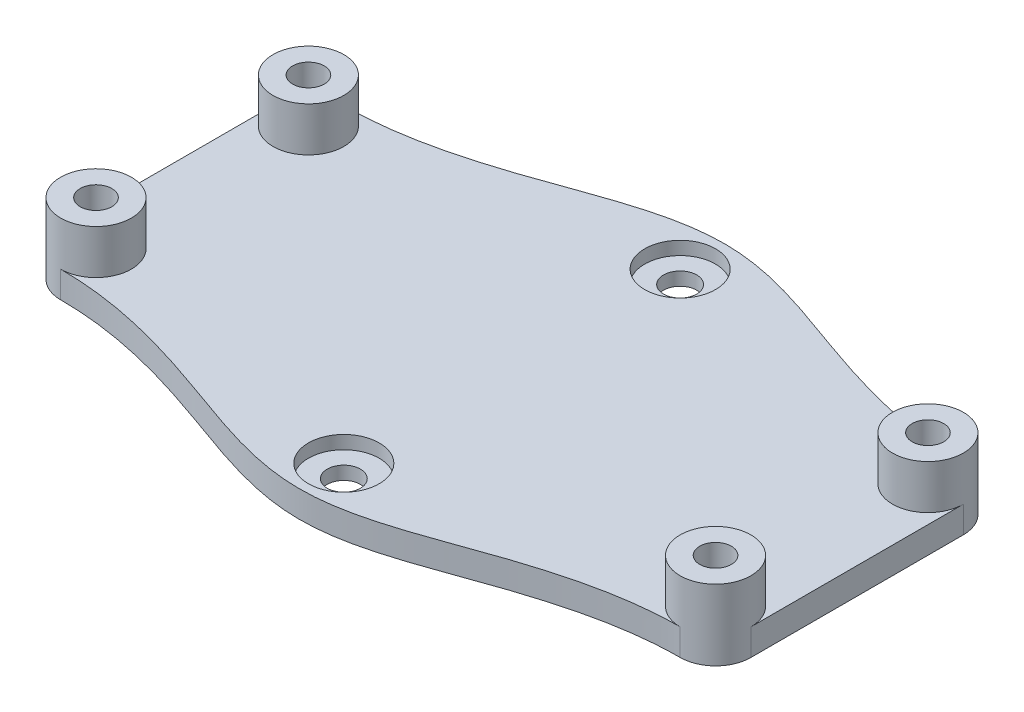
ISO-10303-21;
HEADER;
FILE_DESCRIPTION(('STEP AP214'),'2;1');
FILE_NAME('part.step','',(''),(''),'','','');
FILE_SCHEMA(('AUTOMOTIVE_DESIGN { 1 0 10303 214 1 1 1 1 }'));
ENDSEC;
DATA;
#1=APPLICATION_CONTEXT('core data for automotive mechanical design processes');
#2=APPLICATION_PROTOCOL_DEFINITION('international standard','automotive_design',2000,#1);
#3=PRODUCT_CONTEXT('',#1,'mechanical');
#4=PRODUCT('Part','Part','',(#3));
#5=PRODUCT_RELATED_PRODUCT_CATEGORY('part','',(#4));
#6=PRODUCT_DEFINITION_FORMATION('','',#4);
#7=PRODUCT_DEFINITION_CONTEXT('part definition',#1,'design');
#8=PRODUCT_DEFINITION('design','',#6,#7);
#9=PRODUCT_DEFINITION_SHAPE('','',#8);
#10=(LENGTH_UNIT() NAMED_UNIT(*) SI_UNIT(.MILLI.,.METRE.));
#11=(NAMED_UNIT(*) PLANE_ANGLE_UNIT() SI_UNIT($,.RADIAN.));
#12=(NAMED_UNIT(*) SI_UNIT($,.STERADIAN.) SOLID_ANGLE_UNIT());
#13=UNCERTAINTY_MEASURE_WITH_UNIT(LENGTH_MEASURE(1.E-05),#10,'distance_accuracy_value','');
#14=(GEOMETRIC_REPRESENTATION_CONTEXT(3) GLOBAL_UNCERTAINTY_ASSIGNED_CONTEXT((#13)) GLOBAL_UNIT_ASSIGNED_CONTEXT((#10,
#11,#12)) REPRESENTATION_CONTEXT('',''));
#15=CARTESIAN_POINT('',(0.,0.,0.));
#16=DIRECTION('',(0.,0.,1.));
#17=DIRECTION('',(1.,0.,0.));
#18=AXIS2_PLACEMENT_3D('',#15,#16,#17);
#19=CARTESIAN_POINT('',(-36.2518684526485,-3.,-6.01017819083383));
#20=DIRECTION('',(0.,1.,0.));
#21=DIRECTION('',(0.,0.,1.));
#22=AXIS2_PLACEMENT_3D('',#19,#20,#21);
#23=CYLINDRICAL_SURFACE('',#22,4.);
#24=DIRECTION('',(0.,1.,0.));
#25=VECTOR('',#24,1.);
#26=CARTESIAN_POINT('',(-40.2518684526485,-3.,-6.01017819083383));
#27=LINE('',#26,#25);
#28=CARTESIAN_POINT('',(-40.2518684526485,-3.,-6.01017819083383));
#29=VERTEX_POINT('',#28);
#30=CARTESIAN_POINT('',(-40.2518684526485,0.,-6.01017819083383));
#31=VERTEX_POINT('',#30);
#32=EDGE_CURVE('E91',#29,#31,#27,.T.);
#33=ORIENTED_EDGE('',*,*,#32,.T.);
#34=CARTESIAN_POINT('',(-36.2518684526485,0.,-6.01017819083383));
#35=DIRECTION('',(0.,-1.,0.));
#36=DIRECTION('',(0.,0.,-1.));
#37=AXIS2_PLACEMENT_3D('',#34,#35,#36);
#38=CIRCLE('',#37,4.);
#39=CARTESIAN_POINT('',(-36.2518684526485,0.,-10.0101781908338));
#40=VERTEX_POINT('',#39);
#41=EDGE_CURVE('E277',#31,#40,#38,.F.);
#42=ORIENTED_EDGE('',*,*,#41,.T.);
#43=DIRECTION('',(0.,1.,0.));
#44=VECTOR('',#43,1.);
#45=CARTESIAN_POINT('',(-36.2518684526485,-3.,-10.0101781908338));
#46=LINE('',#45,#44);
#47=CARTESIAN_POINT('',(-36.2518684526485,-3.,-10.0101781908338));
#48=VERTEX_POINT('',#47);
#49=EDGE_CURVE('E58',#48,#40,#46,.T.);
#50=ORIENTED_EDGE('',*,*,#49,.F.);
#51=CARTESIAN_POINT('',(-36.2518684526485,-3.,-6.01017819083383));
#52=DIRECTION('',(0.,1.,0.));
#53=DIRECTION('',(0.,0.,-1.));
#54=AXIS2_PLACEMENT_3D('',#51,#52,#53);
#55=CIRCLE('',#54,4.);
#56=EDGE_CURVE('E186',#48,#29,#55,.T.);
#57=ORIENTED_EDGE('',*,*,#56,.T.);
#58=EDGE_LOOP('',(#33,#42,#50,#57));
#59=FACE_BOUND('',#58,.T.);
#60=CARTESIAN_POINT('',(-36.2518684526485,5.,-6.01017819083383));
#61=DIRECTION('',(0.,1.,0.));
#62=DIRECTION('',(0.,0.,1.));
#63=AXIS2_PLACEMENT_3D('',#60,#61,#62);
#64=CIRCLE('',#63,4.);
#65=CARTESIAN_POINT('',(-36.2518684526485,5.,-2.01017819083383));
#66=VERTEX_POINT('',#65);
#67=EDGE_CURVE('E203',#66,#66,#64,.T.);
#68=ORIENTED_EDGE('',*,*,#67,.F.);
#69=EDGE_LOOP('',(#68));
#70=FACE_BOUND('',#69,.T.);
#71=ADVANCED_FACE('F39',(#59,#70),#23,.T.);
#72=CARTESIAN_POINT('',(33.7481315473515,-3.,-10.0101781908338));
#73=CARTESIAN_POINT('',(27.8238619002682,-3.,-10.0101781908338));
#74=CARTESIAN_POINT('',(16.740137150134,-3.,-12.8935152807625));
#75=CARTESIAN_POINT('',(4.57410249745538,-3.,-18.0325564843901));
#76=CARTESIAN_POINT('',(-7.07782545586437,-3.,-18.032556484398));
#77=CARTESIAN_POINT('',(-19.2470629279089,-3.,-12.8935152807587));
#78=CARTESIAN_POINT('',(-30.3202470507345,-3.,-10.0101781908338));
#79=CARTESIAN_POINT('',(-36.2518684526485,-3.,-10.0101781908338));
#80=B_SPLINE_CURVE_WITH_KNOTS('',3,(#72,#73,#74,#75,#76,#77,#78,#79),.UNSPECIFIED.,.F.,.F.,(4,1,
1,1,1,4),(0.,0.248449552771805,0.47484495527718,0.525155044722819,0.751550447228195,1.),.UNSPECIFIED.);
#81=DIRECTION('',(0.,1.,0.));
#82=VECTOR('',#81,1.);
#83=SURFACE_OF_LINEAR_EXTRUSION('',#80,#82);
#84=CARTESIAN_POINT('',(33.7481315473515,0.,-10.0101781908338));
#85=CARTESIAN_POINT('',(27.8238619002682,0.,-10.0101781908338));
#86=CARTESIAN_POINT('',(16.740137150134,0.,-12.8935152807625));
#87=CARTESIAN_POINT('',(4.57410249745538,0.,-18.0325564843901));
#88=CARTESIAN_POINT('',(-7.07782545586437,0.,-18.032556484398));
#89=CARTESIAN_POINT('',(-19.2470629279089,0.,-12.8935152807587));
#90=CARTESIAN_POINT('',(-30.3202470507345,0.,-10.0101781908338));
#91=CARTESIAN_POINT('',(-36.2518684526485,0.,-10.0101781908338));
#92=B_SPLINE_CURVE_WITH_KNOTS('',3,(#84,#85,#86,#87,#88,#89,#90,#91),.UNSPECIFIED.,.F.,.F.,(4,1,
1,1,1,4),(0.,0.248449552771805,0.47484495527718,0.525155044722819,0.751550447228195,1.),.UNSPECIFIED.);
#93=CARTESIAN_POINT('',(33.7481315473515,0.,-10.0101781908338));
#94=VERTEX_POINT('',#93);
#95=EDGE_CURVE('E189',#94,#40,#92,.T.);
#96=ORIENTED_EDGE('',*,*,#95,.F.);
#97=DIRECTION('',(0.,1.,0.));
#98=VECTOR('',#97,1.);
#99=CARTESIAN_POINT('',(33.7481315473515,-3.,-10.0101781908338));
#100=LINE('',#99,#98);
#101=CARTESIAN_POINT('',(33.7481315473515,-3.,-10.0101781908338));
#102=VERTEX_POINT('',#101);
#103=EDGE_CURVE('E117',#102,#94,#100,.T.);
#104=ORIENTED_EDGE('',*,*,#103,.F.);
#105=EDGE_CURVE('E127',#102,#48,#80,.T.);
#106=ORIENTED_EDGE('',*,*,#105,.T.);
#107=ORIENTED_EDGE('',*,*,#49,.T.);
#108=EDGE_LOOP('',(#96,#104,#106,#107));
#109=FACE_BOUND('',#108,.T.);
#110=ADVANCED_FACE('F150',(#109),#83,.T.);
#111=CARTESIAN_POINT('',(33.7481315473515,-3.,-6.01017819083383));
#112=DIRECTION('',(0.,1.,0.));
#113=DIRECTION('',(0.,0.,1.));
#114=AXIS2_PLACEMENT_3D('',#111,#112,#113);
#115=CYLINDRICAL_SURFACE('',#114,4.);
#116=ORIENTED_EDGE('',*,*,#103,.T.);
#117=CARTESIAN_POINT('',(33.7481315473515,0.,-6.01017819083383));
#118=DIRECTION('',(0.,-1.,0.));
#119=DIRECTION('',(0.,0.,-1.));
#120=AXIS2_PLACEMENT_3D('',#117,#118,#119);
#121=CIRCLE('',#120,4.);
#122=CARTESIAN_POINT('',(37.7481315473515,0.,-6.01017819083383));
#123=VERTEX_POINT('',#122);
#124=EDGE_CURVE('E49',#94,#123,#121,.F.);
#125=ORIENTED_EDGE('',*,*,#124,.T.);
#126=DIRECTION('',(0.,1.,0.));
#127=VECTOR('',#126,1.);
#128=CARTESIAN_POINT('',(37.7481315473515,-3.,-6.01017819083383));
#129=LINE('',#128,#127);
#130=CARTESIAN_POINT('',(37.7481315473515,-3.,-6.01017819083383));
#131=VERTEX_POINT('',#130);
#132=EDGE_CURVE('E83',#131,#123,#129,.T.);
#133=ORIENTED_EDGE('',*,*,#132,.F.);
#134=CARTESIAN_POINT('',(33.7481315473515,-3.,-6.01017819083383));
#135=DIRECTION('',(0.,1.,0.));
#136=DIRECTION('',(0.,0.,1.));
#137=AXIS2_PLACEMENT_3D('',#134,#135,#136);
#138=CIRCLE('',#137,4.);
#139=EDGE_CURVE('E113',#131,#102,#138,.T.);
#140=ORIENTED_EDGE('',*,*,#139,.T.);
#141=EDGE_LOOP('',(#116,#125,#133,#140));
#142=FACE_BOUND('',#141,.T.);
#143=CARTESIAN_POINT('',(33.7481315473515,5.,-6.01017819083383));
#144=DIRECTION('',(0.,1.,0.));
#145=DIRECTION('',(0.,0.,1.));
#146=AXIS2_PLACEMENT_3D('',#143,#144,#145);
#147=CIRCLE('',#146,4.);
#148=CARTESIAN_POINT('',(33.7481315473515,5.,-2.01017819083383));
#149=VERTEX_POINT('',#148);
#150=EDGE_CURVE('E215',#149,#149,#147,.T.);
#151=ORIENTED_EDGE('',*,*,#150,.F.);
#152=EDGE_LOOP('',(#151));
#153=FACE_BOUND('',#152,.T.);
#154=ADVANCED_FACE('F111',(#142,#153),#115,.T.);
#155=CARTESIAN_POINT('',(37.7481315473515,-3.,-6.01017819083383));
#156=DIRECTION('',(1.,0.,0.));
#157=DIRECTION('',(0.,0.,-1.));
#158=AXIS2_PLACEMENT_3D('',#155,#156,#157);
#159=PLANE('',#158);
#160=DIRECTION('',(0.,0.,-1.));
#161=VECTOR('',#160,1.);
#162=CARTESIAN_POINT('',(37.7481315473515,0.,-6.01017819083383));
#163=LINE('',#162,#161);
#164=CARTESIAN_POINT('',(37.7481315473515,0.,17.9898218091662));
#165=VERTEX_POINT('',#164);
#166=EDGE_CURVE('E304',#165,#123,#163,.T.);
#167=ORIENTED_EDGE('',*,*,#166,.F.);
#168=DIRECTION('',(0.,1.,0.));
#169=VECTOR('',#168,1.);
#170=CARTESIAN_POINT('',(37.7481315473515,-3.,17.9898218091662));
#171=LINE('',#170,#169);
#172=CARTESIAN_POINT('',(37.7481315473515,-3.,17.9898218091662));
#173=VERTEX_POINT('',#172);
#174=EDGE_CURVE('E118',#173,#165,#171,.T.);
#175=ORIENTED_EDGE('',*,*,#174,.F.);
#176=DIRECTION('',(0.,0.,-1.));
#177=VECTOR('',#176,1.);
#178=CARTESIAN_POINT('',(37.7481315473515,-3.,-6.01017819083383));
#179=LINE('',#178,#177);
#180=EDGE_CURVE('E124',#173,#131,#179,.T.);
#181=ORIENTED_EDGE('',*,*,#180,.T.);
#182=ORIENTED_EDGE('',*,*,#132,.T.);
#183=EDGE_LOOP('',(#167,#175,#181,#182));
#184=FACE_BOUND('',#183,.T.);
#185=ADVANCED_FACE('F130',(#184),#159,.T.);
#186=CARTESIAN_POINT('',(33.7481315473515,-3.,17.9898218091662));
#187=DIRECTION('',(0.,1.,0.));
#188=DIRECTION('',(0.,0.,1.));
#189=AXIS2_PLACEMENT_3D('',#186,#187,#188);
#190=CYLINDRICAL_SURFACE('',#189,4.);
#191=ORIENTED_EDGE('',*,*,#174,.T.);
#192=CARTESIAN_POINT('',(33.7481315473515,0.,17.9898218091662));
#193=DIRECTION('',(0.,-1.,0.));
#194=DIRECTION('',(0.,0.,-1.));
#195=AXIS2_PLACEMENT_3D('',#192,#193,#194);
#196=CIRCLE('',#195,4.);
#197=CARTESIAN_POINT('',(33.7481315473515,0.,21.9898218091662));
#198=VERTEX_POINT('',#197);
#199=EDGE_CURVE('E11',#165,#198,#196,.F.);
#200=ORIENTED_EDGE('',*,*,#199,.T.);
#201=DIRECTION('',(0.,1.,0.));
#202=VECTOR('',#201,1.);
#203=CARTESIAN_POINT('',(33.7481315473515,-3.,21.9898218091662));
#204=LINE('',#203,#202);
#205=CARTESIAN_POINT('',(33.7481315473515,-3.,21.9898218091662));
#206=VERTEX_POINT('',#205);
#207=EDGE_CURVE('E289',#206,#198,#204,.T.);
#208=ORIENTED_EDGE('',*,*,#207,.F.);
#209=CARTESIAN_POINT('',(33.7481315473515,-3.,17.9898218091662));
#210=DIRECTION('',(0.,1.,0.));
#211=DIRECTION('',(0.,0.,1.));
#212=AXIS2_PLACEMENT_3D('',#209,#210,#211);
#213=CIRCLE('',#212,4.);
#214=EDGE_CURVE('E132',#206,#173,#213,.T.);
#215=ORIENTED_EDGE('',*,*,#214,.T.);
#216=EDGE_LOOP('',(#191,#200,#208,#215));
#217=FACE_BOUND('',#216,.T.);
#218=CARTESIAN_POINT('',(33.7481315473515,5.,17.9898218091662));
#219=DIRECTION('',(0.,1.,0.));
#220=DIRECTION('',(0.,0.,1.));
#221=AXIS2_PLACEMENT_3D('',#218,#219,#220);
#222=CIRCLE('',#221,4.);
#223=CARTESIAN_POINT('',(33.7481315473515,5.,21.9898218091662));
#224=VERTEX_POINT('',#223);
#225=EDGE_CURVE('E227',#224,#224,#222,.T.);
#226=ORIENTED_EDGE('',*,*,#225,.F.);
#227=EDGE_LOOP('',(#226));
#228=FACE_BOUND('',#227,.T.);
#229=ADVANCED_FACE('F161',(#217,#228),#190,.T.);
#230=CARTESIAN_POINT('',(-36.2518684526485,-3.,21.9898218091662));
#231=CARTESIAN_POINT('',(-30.3275988055651,-3.,21.9898218091662));
#232=CARTESIAN_POINT('',(-19.243874055431,-3.,24.8731588990927));
#233=CARTESIAN_POINT('',(-7.07783940275235,-3.,30.0122001027269));
#234=CARTESIAN_POINT('',(4.57408855056741,-3.,30.0122001027259));
#235=CARTESIAN_POINT('',(16.7433260226119,-3.,24.8731588990932));
#236=CARTESIAN_POINT('',(27.8165101454375,-3.,21.9898218091662));
#237=CARTESIAN_POINT('',(33.7481315473515,-3.,21.9898218091662));
#238=B_SPLINE_CURVE_WITH_KNOTS('',3,(#230,#231,#232,#233,#234,#235,#236,#237),.UNSPECIFIED.,.F.,
.F.,(4,1,1,1,1,4),(0.,0.248449552771805,0.474844955277181,0.525155044722819,0.751550447228195,
1.),.UNSPECIFIED.);
#239=DIRECTION('',(0.,1.,0.));
#240=VECTOR('',#239,1.);
#241=SURFACE_OF_LINEAR_EXTRUSION('',#238,#240);
#242=CARTESIAN_POINT('',(-36.2518684526485,0.,21.9898218091662));
#243=CARTESIAN_POINT('',(-30.3275988055651,0.,21.9898218091662));
#244=CARTESIAN_POINT('',(-19.243874055431,0.,24.8731588990927));
#245=CARTESIAN_POINT('',(-7.07783940275235,0.,30.0122001027269));
#246=CARTESIAN_POINT('',(4.57408855056741,0.,30.0122001027259));
#247=CARTESIAN_POINT('',(16.7433260226119,0.,24.8731588990932));
#248=CARTESIAN_POINT('',(27.8165101454375,0.,21.9898218091662));
#249=CARTESIAN_POINT('',(33.7481315473515,0.,21.9898218091662));
#250=B_SPLINE_CURVE_WITH_KNOTS('',3,(#242,#243,#244,#245,#246,#247,#248,#249),.UNSPECIFIED.,.F.,
.F.,(4,1,1,1,1,4),(0.,0.248449552771805,0.474844955277181,0.525155044722819,0.751550447228195,
1.),.UNSPECIFIED.);
#251=CARTESIAN_POINT('',(-36.2518684526485,0.,21.9898218091662));
#252=VERTEX_POINT('',#251);
#253=EDGE_CURVE('E309',#252,#198,#250,.T.);
#254=ORIENTED_EDGE('',*,*,#253,.F.);
#255=DIRECTION('',(0.,1.,0.));
#256=VECTOR('',#255,1.);
#257=CARTESIAN_POINT('',(-36.2518684526485,-3.,21.9898218091662));
#258=LINE('',#257,#256);
#259=CARTESIAN_POINT('',(-36.2518684526485,-3.,21.9898218091662));
#260=VERTEX_POINT('',#259);
#261=EDGE_CURVE('E285',#260,#252,#258,.T.);
#262=ORIENTED_EDGE('',*,*,#261,.F.);
#263=EDGE_CURVE('E135',#260,#206,#238,.T.);
#264=ORIENTED_EDGE('',*,*,#263,.T.);
#265=ORIENTED_EDGE('',*,*,#207,.T.);
#266=EDGE_LOOP('',(#254,#262,#264,#265));
#267=FACE_BOUND('',#266,.T.);
#268=ADVANCED_FACE('F164',(#267),#241,.T.);
#269=CARTESIAN_POINT('',(-36.2518684526485,-3.,17.9898218091662));
#270=DIRECTION('',(0.,1.,0.));
#271=DIRECTION('',(0.,0.,1.));
#272=AXIS2_PLACEMENT_3D('',#269,#270,#271);
#273=CYLINDRICAL_SURFACE('',#272,4.);
#274=ORIENTED_EDGE('',*,*,#261,.T.);
#275=CARTESIAN_POINT('',(-36.2518684526485,0.,17.9898218091662));
#276=DIRECTION('',(0.,1.,0.));
#277=DIRECTION('',(0.,0.,1.));
#278=AXIS2_PLACEMENT_3D('',#275,#276,#277);
#279=CIRCLE('',#278,4.);
#280=CARTESIAN_POINT('',(-40.2518684526485,0.,17.9898218091662));
#281=VERTEX_POINT('',#280);
#282=EDGE_CURVE('E190',#252,#281,#279,.T.);
#283=ORIENTED_EDGE('',*,*,#282,.T.);
#284=DIRECTION('',(0.,1.,0.));
#285=VECTOR('',#284,1.);
#286=CARTESIAN_POINT('',(-40.2518684526485,-3.,17.9898218091662));
#287=LINE('',#286,#285);
#288=CARTESIAN_POINT('',(-40.2518684526485,-3.,17.9898218091662));
#289=VERTEX_POINT('',#288);
#290=EDGE_CURVE('E282',#289,#281,#287,.T.);
#291=ORIENTED_EDGE('',*,*,#290,.F.);
#292=CARTESIAN_POINT('',(-36.2518684526485,-3.,17.9898218091662));
#293=DIRECTION('',(0.,1.,0.));
#294=DIRECTION('',(0.,0.,1.));
#295=AXIS2_PLACEMENT_3D('',#292,#293,#294);
#296=CIRCLE('',#295,4.);
#297=EDGE_CURVE('E176',#289,#260,#296,.T.);
#298=ORIENTED_EDGE('',*,*,#297,.T.);
#299=EDGE_LOOP('',(#274,#283,#291,#298));
#300=FACE_BOUND('',#299,.T.);
#301=CARTESIAN_POINT('',(-36.2518684526485,5.,17.9898218091662));
#302=DIRECTION('',(0.,1.,0.));
#303=DIRECTION('',(0.,0.,1.));
#304=AXIS2_PLACEMENT_3D('',#301,#302,#303);
#305=CIRCLE('',#304,4.);
#306=CARTESIAN_POINT('',(-36.2518684526485,5.,21.9898218091662));
#307=VERTEX_POINT('',#306);
#308=EDGE_CURVE('E194',#307,#307,#305,.T.);
#309=ORIENTED_EDGE('',*,*,#308,.F.);
#310=EDGE_LOOP('',(#309));
#311=FACE_BOUND('',#310,.T.);
#312=ADVANCED_FACE('F168',(#300,#311),#273,.T.);
#313=CARTESIAN_POINT('',(-40.2518684526485,-3.,-6.01017819083383));
#314=DIRECTION('',(-1.,0.,0.));
#315=DIRECTION('',(0.,0.,1.));
#316=AXIS2_PLACEMENT_3D('',#313,#314,#315);
#317=PLANE('',#316);
#318=DIRECTION('',(0.,0.,1.));
#319=VECTOR('',#318,1.);
#320=CARTESIAN_POINT('',(-40.2518684526485,0.,-6.01017819083383));
#321=LINE('',#320,#319);
#322=EDGE_CURVE('E144',#31,#281,#321,.T.);
#323=ORIENTED_EDGE('',*,*,#322,.F.);
#324=ORIENTED_EDGE('',*,*,#32,.F.);
#325=DIRECTION('',(0.,0.,1.));
#326=VECTOR('',#325,1.);
#327=CARTESIAN_POINT('',(-40.2518684526485,-3.,-6.01017819083383));
#328=LINE('',#327,#326);
#329=EDGE_CURVE('E183',#29,#289,#328,.T.);
#330=ORIENTED_EDGE('',*,*,#329,.T.);
#331=ORIENTED_EDGE('',*,*,#290,.T.);
#332=EDGE_LOOP('',(#323,#324,#330,#331));
#333=FACE_BOUND('',#332,.T.);
#334=ADVANCED_FACE('F332',(#333),#317,.T.);
#335=CARTESIAN_POINT('',(-36.2518684526485,-3.,-6.01017819083383));
#336=DIRECTION('',(0.,-1.,0.));
#337=DIRECTION('',(0.,0.,-1.));
#338=AXIS2_PLACEMENT_3D('',#335,#336,#337);
#339=PLANE('',#338);
#340=CARTESIAN_POINT('',(-1.25186845264849,-3.,24.9898218091662));
#341=DIRECTION('',(0.,1.,0.));
#342=DIRECTION('',(0.,0.,1.));
#343=AXIS2_PLACEMENT_3D('',#340,#341,#342);
#344=CIRCLE('',#343,1.875);
#345=CARTESIAN_POINT('',(-1.25186845264849,-3.,26.8648218091662));
#346=VERTEX_POINT('',#345);
#347=EDGE_CURVE('E262',#346,#346,#344,.T.);
#348=ORIENTED_EDGE('',*,*,#347,.T.);
#349=EDGE_LOOP('',(#348));
#350=FACE_BOUND('',#349,.T.);
#351=CARTESIAN_POINT('',(-1.2518684526485,-3.,-13.0101781908338));
#352=DIRECTION('',(0.,1.,0.));
#353=DIRECTION('',(0.,0.,1.));
#354=AXIS2_PLACEMENT_3D('',#351,#352,#353);
#355=CIRCLE('',#354,1.875);
#356=CARTESIAN_POINT('',(-1.2518684526485,-3.,-11.1351781908338));
#357=VERTEX_POINT('',#356);
#358=EDGE_CURVE('E258',#357,#357,#355,.T.);
#359=ORIENTED_EDGE('',*,*,#358,.T.);
#360=EDGE_LOOP('',(#359));
#361=FACE_BOUND('',#360,.T.);
#362=ORIENTED_EDGE('',*,*,#56,.F.);
#363=ORIENTED_EDGE('',*,*,#105,.F.);
#364=ORIENTED_EDGE('',*,*,#139,.F.);
#365=ORIENTED_EDGE('',*,*,#180,.F.);
#366=ORIENTED_EDGE('',*,*,#214,.F.);
#367=ORIENTED_EDGE('',*,*,#263,.F.);
#368=ORIENTED_EDGE('',*,*,#297,.F.);
#369=ORIENTED_EDGE('',*,*,#329,.F.);
#370=EDGE_LOOP('',(#362,#363,#364,#365,#366,#367,#368,#369));
#371=FACE_BOUND('',#370,.T.);
#372=ADVANCED_FACE('F122',(#350,#361,#371),#339,.T.);
#373=CARTESIAN_POINT('',(-36.2518684526485,0.,-6.01017819083383));
#374=DIRECTION('',(0.,-1.,0.));
#375=DIRECTION('',(0.,0.,-1.));
#376=AXIS2_PLACEMENT_3D('',#373,#374,#375);
#377=PLANE('',#376);
#378=CARTESIAN_POINT('',(-1.2518684526485,0.,-13.0101781908338));
#379=DIRECTION('',(0.,1.,0.));
#380=DIRECTION('',(0.,0.,1.));
#381=AXIS2_PLACEMENT_3D('',#378,#379,#380);
#382=CIRCLE('',#381,4.);
#383=CARTESIAN_POINT('',(-1.2518684526485,0.,-9.01017819083382));
#384=VERTEX_POINT('',#383);
#385=EDGE_CURVE('E251',#384,#384,#382,.T.);
#386=ORIENTED_EDGE('',*,*,#385,.F.);
#387=EDGE_LOOP('',(#386));
#388=FACE_BOUND('',#387,.T.);
#389=CARTESIAN_POINT('',(-1.25186845264849,0.,24.9898218091662));
#390=DIRECTION('',(0.,1.,0.));
#391=DIRECTION('',(0.,0.,1.));
#392=AXIS2_PLACEMENT_3D('',#389,#390,#391);
#393=CIRCLE('',#392,4.);
#394=CARTESIAN_POINT('',(-1.25186845264849,0.,28.9898218091662));
#395=VERTEX_POINT('',#394);
#396=EDGE_CURVE('E243',#395,#395,#393,.T.);
#397=ORIENTED_EDGE('',*,*,#396,.F.);
#398=EDGE_LOOP('',(#397));
#399=FACE_BOUND('',#398,.T.);
#400=ORIENTED_EDGE('',*,*,#199,.F.);
#401=ORIENTED_EDGE('',*,*,#166,.T.);
#402=ORIENTED_EDGE('',*,*,#124,.F.);
#403=ORIENTED_EDGE('',*,*,#95,.T.);
#404=ORIENTED_EDGE('',*,*,#41,.F.);
#405=ORIENTED_EDGE('',*,*,#322,.T.);
#406=ORIENTED_EDGE('',*,*,#282,.F.);
#407=ORIENTED_EDGE('',*,*,#253,.T.);
#408=EDGE_LOOP('',(#400,#401,#402,#403,#404,#405,#406,#407));
#409=FACE_BOUND('',#408,.T.);
#410=ADVANCED_FACE('F155',(#388,#399,#409),#377,.F.);
#411=CARTESIAN_POINT('',(-36.2518684526485,5.,17.9898218091662));
#412=DIRECTION('',(0.,1.,0.));
#413=DIRECTION('',(0.,0.,1.));
#414=AXIS2_PLACEMENT_3D('',#411,#412,#413);
#415=PLANE('',#414);
#416=ORIENTED_EDGE('',*,*,#308,.T.);
#417=EDGE_LOOP('',(#416));
#418=FACE_BOUND('',#417,.T.);
#419=CARTESIAN_POINT('',(-36.2518684526485,5.,17.9898218091662));
#420=DIRECTION('',(0.,1.,0.));
#421=DIRECTION('',(0.,0.,1.));
#422=AXIS2_PLACEMENT_3D('',#419,#420,#421);
#423=CIRCLE('',#422,1.7859375);
#424=CARTESIAN_POINT('',(-36.2518684526485,5.,19.7757593091662));
#425=VERTEX_POINT('',#424);
#426=EDGE_CURVE('E195',#425,#425,#423,.T.);
#427=ORIENTED_EDGE('',*,*,#426,.F.);
#428=EDGE_LOOP('',(#427));
#429=FACE_BOUND('',#428,.T.);
#430=ADVANCED_FACE('F377',(#418,#429),#415,.T.);
#431=CARTESIAN_POINT('',(-36.2518684526485,5.,17.9898218091662));
#432=DIRECTION('',(0.,-1.,0.));
#433=DIRECTION('',(0.,0.,-1.));
#434=AXIS2_PLACEMENT_3D('',#431,#432,#433);
#435=CYLINDRICAL_SURFACE('',#434,1.7859375);
#436=ORIENTED_EDGE('',*,*,#426,.T.);
#437=EDGE_LOOP('',(#436));
#438=FACE_BOUND('',#437,.T.);
#439=CARTESIAN_POINT('',(-36.2518684526485,0.,17.9898218091662));
#440=DIRECTION('',(0.,1.,0.));
#441=DIRECTION('',(0.,0.,1.));
#442=AXIS2_PLACEMENT_3D('',#439,#440,#441);
#443=CIRCLE('',#442,1.7859375);
#444=CARTESIAN_POINT('',(-36.2518684526485,0.,19.7757593091662));
#445=VERTEX_POINT('',#444);
#446=EDGE_CURVE('E199',#445,#445,#443,.T.);
#447=ORIENTED_EDGE('',*,*,#446,.F.);
#448=EDGE_LOOP('',(#447));
#449=FACE_BOUND('',#448,.T.);
#450=ADVANCED_FACE('F381',(#438,#449),#435,.F.);
#451=ORIENTED_EDGE('',*,*,#446,.T.);
#452=EDGE_LOOP('',(#451));
#453=FACE_BOUND('',#452,.T.);
#454=ADVANCED_FACE('F392',(#453),#377,.F.);
#455=CARTESIAN_POINT('',(-36.2518684526485,5.,-6.01017819083383));
#456=DIRECTION('',(0.,1.,0.));
#457=DIRECTION('',(0.,0.,1.));
#458=AXIS2_PLACEMENT_3D('',#455,#456,#457);
#459=PLANE('',#458);
#460=ORIENTED_EDGE('',*,*,#67,.T.);
#461=EDGE_LOOP('',(#460));
#462=FACE_BOUND('',#461,.T.);
#463=CARTESIAN_POINT('',(-36.2518684526485,5.,-6.01017819083383));
#464=DIRECTION('',(0.,1.,0.));
#465=DIRECTION('',(0.,0.,1.));
#466=AXIS2_PLACEMENT_3D('',#463,#464,#465);
#467=CIRCLE('',#466,1.7859375);
#468=CARTESIAN_POINT('',(-36.2518684526485,5.,-4.22424069083382));
#469=VERTEX_POINT('',#468);
#470=EDGE_CURVE('E210',#469,#469,#467,.T.);
#471=ORIENTED_EDGE('',*,*,#470,.F.);
#472=EDGE_LOOP('',(#471));
#473=FACE_BOUND('',#472,.T.);
#474=ADVANCED_FACE('F403',(#462,#473),#459,.T.);
#475=CARTESIAN_POINT('',(-36.2518684526485,5.,-6.01017819083383));
#476=DIRECTION('',(0.,-1.,0.));
#477=DIRECTION('',(0.,0.,-1.));
#478=AXIS2_PLACEMENT_3D('',#475,#476,#477);
#479=CYLINDRICAL_SURFACE('',#478,1.7859375);
#480=ORIENTED_EDGE('',*,*,#470,.T.);
#481=EDGE_LOOP('',(#480));
#482=FACE_BOUND('',#481,.T.);
#483=CARTESIAN_POINT('',(-36.2518684526485,0.,-6.01017819083383));
#484=DIRECTION('',(0.,1.,0.));
#485=DIRECTION('',(0.,0.,1.));
#486=AXIS2_PLACEMENT_3D('',#483,#484,#485);
#487=CIRCLE('',#486,1.7859375);
#488=CARTESIAN_POINT('',(-36.2518684526485,0.,-4.22424069083382));
#489=VERTEX_POINT('',#488);
#490=EDGE_CURVE('E211',#489,#489,#487,.T.);
#491=ORIENTED_EDGE('',*,*,#490,.F.);
#492=EDGE_LOOP('',(#491));
#493=FACE_BOUND('',#492,.T.);
#494=ADVANCED_FACE('F414',(#482,#493),#479,.F.);
#495=ORIENTED_EDGE('',*,*,#490,.T.);
#496=EDGE_LOOP('',(#495));
#497=FACE_BOUND('',#496,.T.);
#498=ADVANCED_FACE('F405',(#497),#377,.F.);
#499=CARTESIAN_POINT('',(33.7481315473515,5.,-6.01017819083383));
#500=DIRECTION('',(0.,1.,0.));
#501=DIRECTION('',(0.,0.,1.));
#502=AXIS2_PLACEMENT_3D('',#499,#500,#501);
#503=PLANE('',#502);
#504=ORIENTED_EDGE('',*,*,#150,.T.);
#505=EDGE_LOOP('',(#504));
#506=FACE_BOUND('',#505,.T.);
#507=CARTESIAN_POINT('',(33.7481315473515,5.,-6.01017819083383));
#508=DIRECTION('',(0.,1.,0.));
#509=DIRECTION('',(0.,0.,1.));
#510=AXIS2_PLACEMENT_3D('',#507,#508,#509);
#511=CIRCLE('',#510,1.7859375);
#512=CARTESIAN_POINT('',(33.7481315473515,5.,-4.22424069083382));
#513=VERTEX_POINT('',#512);
#514=EDGE_CURVE('E222',#513,#513,#511,.T.);
#515=ORIENTED_EDGE('',*,*,#514,.F.);
#516=EDGE_LOOP('',(#515));
#517=FACE_BOUND('',#516,.T.);
#518=ADVANCED_FACE('F433',(#506,#517),#503,.T.);
#519=CARTESIAN_POINT('',(33.7481315473515,5.,-6.01017819083383));
#520=DIRECTION('',(0.,-1.,0.));
#521=DIRECTION('',(0.,0.,-1.));
#522=AXIS2_PLACEMENT_3D('',#519,#520,#521);
#523=CYLINDRICAL_SURFACE('',#522,1.7859375);
#524=ORIENTED_EDGE('',*,*,#514,.T.);
#525=EDGE_LOOP('',(#524));
#526=FACE_BOUND('',#525,.T.);
#527=CARTESIAN_POINT('',(33.7481315473515,0.,-6.01017819083383));
#528=DIRECTION('',(0.,1.,0.));
#529=DIRECTION('',(0.,0.,1.));
#530=AXIS2_PLACEMENT_3D('',#527,#528,#529);
#531=CIRCLE('',#530,1.7859375);
#532=CARTESIAN_POINT('',(33.7481315473515,0.,-4.22424069083382));
#533=VERTEX_POINT('',#532);
#534=EDGE_CURVE('E223',#533,#533,#531,.T.);
#535=ORIENTED_EDGE('',*,*,#534,.F.);
#536=EDGE_LOOP('',(#535));
#537=FACE_BOUND('',#536,.T.);
#538=ADVANCED_FACE('F443',(#526,#537),#523,.F.);
#539=ORIENTED_EDGE('',*,*,#534,.T.);
#540=EDGE_LOOP('',(#539));
#541=FACE_BOUND('',#540,.T.);
#542=ADVANCED_FACE('F435',(#541),#377,.F.);
#543=CARTESIAN_POINT('',(33.7481315473515,5.,17.9898218091662));
#544=DIRECTION('',(0.,1.,0.));
#545=DIRECTION('',(0.,0.,1.));
#546=AXIS2_PLACEMENT_3D('',#543,#544,#545);
#547=PLANE('',#546);
#548=ORIENTED_EDGE('',*,*,#225,.T.);
#549=EDGE_LOOP('',(#548));
#550=FACE_BOUND('',#549,.T.);
#551=CARTESIAN_POINT('',(33.7481315473515,5.,17.9898218091662));
#552=DIRECTION('',(0.,1.,0.));
#553=DIRECTION('',(0.,0.,1.));
#554=AXIS2_PLACEMENT_3D('',#551,#552,#553);
#555=CIRCLE('',#554,1.7859375);
#556=CARTESIAN_POINT('',(33.7481315473515,5.,19.7757593091662));
#557=VERTEX_POINT('',#556);
#558=EDGE_CURVE('E234',#557,#557,#555,.T.);
#559=ORIENTED_EDGE('',*,*,#558,.F.);
#560=EDGE_LOOP('',(#559));
#561=FACE_BOUND('',#560,.T.);
#562=ADVANCED_FACE('F462',(#550,#561),#547,.T.);
#563=CARTESIAN_POINT('',(33.7481315473515,5.,17.9898218091662));
#564=DIRECTION('',(0.,-1.,0.));
#565=DIRECTION('',(0.,0.,-1.));
#566=AXIS2_PLACEMENT_3D('',#563,#564,#565);
#567=CYLINDRICAL_SURFACE('',#566,1.7859375);
#568=ORIENTED_EDGE('',*,*,#558,.T.);
#569=EDGE_LOOP('',(#568));
#570=FACE_BOUND('',#569,.T.);
#571=CARTESIAN_POINT('',(33.7481315473515,0.,17.9898218091662));
#572=DIRECTION('',(0.,1.,0.));
#573=DIRECTION('',(0.,0.,1.));
#574=AXIS2_PLACEMENT_3D('',#571,#572,#573);
#575=CIRCLE('',#574,1.7859375);
#576=CARTESIAN_POINT('',(33.7481315473515,0.,19.7757593091662));
#577=VERTEX_POINT('',#576);
#578=EDGE_CURVE('E235',#577,#577,#575,.T.);
#579=ORIENTED_EDGE('',*,*,#578,.F.);
#580=EDGE_LOOP('',(#579));
#581=FACE_BOUND('',#580,.T.);
#582=ADVANCED_FACE('F472',(#570,#581),#567,.F.);
#583=ORIENTED_EDGE('',*,*,#578,.T.);
#584=EDGE_LOOP('',(#583));
#585=FACE_BOUND('',#584,.T.);
#586=ADVANCED_FACE('F464',(#585),#377,.F.);
#587=CARTESIAN_POINT('',(-1.25186845264849,-1.5,24.9898218091662));
#588=DIRECTION('',(0.,1.,0.));
#589=DIRECTION('',(0.,0.,1.));
#590=AXIS2_PLACEMENT_3D('',#587,#588,#589);
#591=CYLINDRICAL_SURFACE('',#590,4.);
#592=CARTESIAN_POINT('',(-1.25186845264849,-1.5,24.9898218091662));
#593=DIRECTION('',(0.,1.,0.));
#594=DIRECTION('',(0.,0.,1.));
#595=AXIS2_PLACEMENT_3D('',#592,#593,#594);
#596=CIRCLE('',#595,4.);
#597=CARTESIAN_POINT('',(-1.25186845264849,-1.5,28.9898218091662));
#598=VERTEX_POINT('',#597);
#599=EDGE_CURVE('E247',#598,#598,#596,.T.);
#600=ORIENTED_EDGE('',*,*,#599,.F.);
#601=EDGE_LOOP('',(#600));
#602=FACE_BOUND('',#601,.T.);
#603=ORIENTED_EDGE('',*,*,#396,.T.);
#604=EDGE_LOOP('',(#603));
#605=FACE_BOUND('',#604,.T.);
#606=ADVANCED_FACE('F491',(#602,#605),#591,.F.);
#607=CARTESIAN_POINT('',(-1.25186845264849,-1.5,24.9898218091662));
#608=DIRECTION('',(0.,1.,0.));
#609=DIRECTION('',(0.,0.,1.));
#610=AXIS2_PLACEMENT_3D('',#607,#608,#609);
#611=PLANE('',#610);
#612=CARTESIAN_POINT('',(-1.25186845264849,-1.5,24.9898218091662));
#613=DIRECTION('',(0.,1.,0.));
#614=DIRECTION('',(0.,0.,1.));
#615=AXIS2_PLACEMENT_3D('',#612,#613,#614);
#616=CIRCLE('',#615,1.875);
#617=CARTESIAN_POINT('',(-1.25186845264849,-1.5,26.8648218091662));
#618=VERTEX_POINT('',#617);
#619=EDGE_CURVE('E42',#618,#618,#616,.T.);
#620=ORIENTED_EDGE('',*,*,#619,.F.);
#621=EDGE_LOOP('',(#620));
#622=FACE_BOUND('',#621,.T.);
#623=ORIENTED_EDGE('',*,*,#599,.T.);
#624=EDGE_LOOP('',(#623));
#625=FACE_BOUND('',#624,.T.);
#626=ADVANCED_FACE('F505',(#622,#625),#611,.T.);
#627=CARTESIAN_POINT('',(-1.2518684526485,-1.5,-13.0101781908338));
#628=DIRECTION('',(0.,1.,0.));
#629=DIRECTION('',(0.,0.,1.));
#630=AXIS2_PLACEMENT_3D('',#627,#628,#629);
#631=CYLINDRICAL_SURFACE('',#630,4.);
#632=CARTESIAN_POINT('',(-1.2518684526485,-1.5,-13.0101781908338));
#633=DIRECTION('',(0.,1.,0.));
#634=DIRECTION('',(0.,0.,1.));
#635=AXIS2_PLACEMENT_3D('',#632,#633,#634);
#636=CIRCLE('',#635,4.);
#637=CARTESIAN_POINT('',(-1.2518684526485,-1.5,-9.01017819083382));
#638=VERTEX_POINT('',#637);
#639=EDGE_CURVE('E239',#638,#638,#636,.T.);
#640=ORIENTED_EDGE('',*,*,#639,.F.);
#641=EDGE_LOOP('',(#640));
#642=FACE_BOUND('',#641,.T.);
#643=ORIENTED_EDGE('',*,*,#385,.T.);
#644=EDGE_LOOP('',(#643));
#645=FACE_BOUND('',#644,.T.);
#646=ADVANCED_FACE('F513',(#642,#645),#631,.F.);
#647=CARTESIAN_POINT('',(-1.2518684526485,-1.5,-13.0101781908338));
#648=DIRECTION('',(0.,1.,0.));
#649=DIRECTION('',(0.,0.,1.));
#650=AXIS2_PLACEMENT_3D('',#647,#648,#649);
#651=PLANE('',#650);
#652=CARTESIAN_POINT('',(-1.2518684526485,-1.5,-13.0101781908338));
#653=DIRECTION('',(0.,1.,0.));
#654=DIRECTION('',(0.,0.,1.));
#655=AXIS2_PLACEMENT_3D('',#652,#653,#654);
#656=CIRCLE('',#655,1.875);
#657=CARTESIAN_POINT('',(-1.2518684526485,-1.5,-11.1351781908338));
#658=VERTEX_POINT('',#657);
#659=EDGE_CURVE('E265',#658,#658,#656,.T.);
#660=ORIENTED_EDGE('',*,*,#659,.F.);
#661=EDGE_LOOP('',(#660));
#662=FACE_BOUND('',#661,.T.);
#663=ORIENTED_EDGE('',*,*,#639,.T.);
#664=EDGE_LOOP('',(#663));
#665=FACE_BOUND('',#664,.T.);
#666=ADVANCED_FACE('F518',(#662,#665),#651,.T.);
#667=CARTESIAN_POINT('',(-1.2518684526485,-3.,-13.0101781908338));
#668=DIRECTION('',(0.,1.,0.));
#669=DIRECTION('',(0.,0.,1.));
#670=AXIS2_PLACEMENT_3D('',#667,#668,#669);
#671=CYLINDRICAL_SURFACE('',#670,1.875);
#672=ORIENTED_EDGE('',*,*,#659,.T.);
#673=EDGE_LOOP('',(#672));
#674=FACE_BOUND('',#673,.T.);
#675=ORIENTED_EDGE('',*,*,#358,.F.);
#676=EDGE_LOOP('',(#675));
#677=FACE_BOUND('',#676,.T.);
#678=ADVANCED_FACE('F540',(#674,#677),#671,.F.);
#679=CARTESIAN_POINT('',(-1.25186845264849,-3.,24.9898218091662));
#680=DIRECTION('',(0.,1.,0.));
#681=DIRECTION('',(0.,0.,1.));
#682=AXIS2_PLACEMENT_3D('',#679,#680,#681);
#683=CYLINDRICAL_SURFACE('',#682,1.875);
#684=ORIENTED_EDGE('',*,*,#619,.T.);
#685=EDGE_LOOP('',(#684));
#686=FACE_BOUND('',#685,.T.);
#687=ORIENTED_EDGE('',*,*,#347,.F.);
#688=EDGE_LOOP('',(#687));
#689=FACE_BOUND('',#688,.T.);
#690=ADVANCED_FACE('F550',(#686,#689),#683,.F.);
#691=CLOSED_SHELL('',(#71,#110,#154,#185,#229,#268,#312,#334,#372,#410,#430,#450,#454,#474,#494,
#498,#518,#538,#542,#562,#582,#586,#606,#626,#646,#666,#678,#690));
#692=MANIFOLD_SOLID_BREP('B2',#691);
#693=ADVANCED_BREP_SHAPE_REPRESENTATION('',(#18,#692),#14);
#694=SHAPE_DEFINITION_REPRESENTATION(#9,#693);
ENDSEC;
END-ISO-10303-21;
